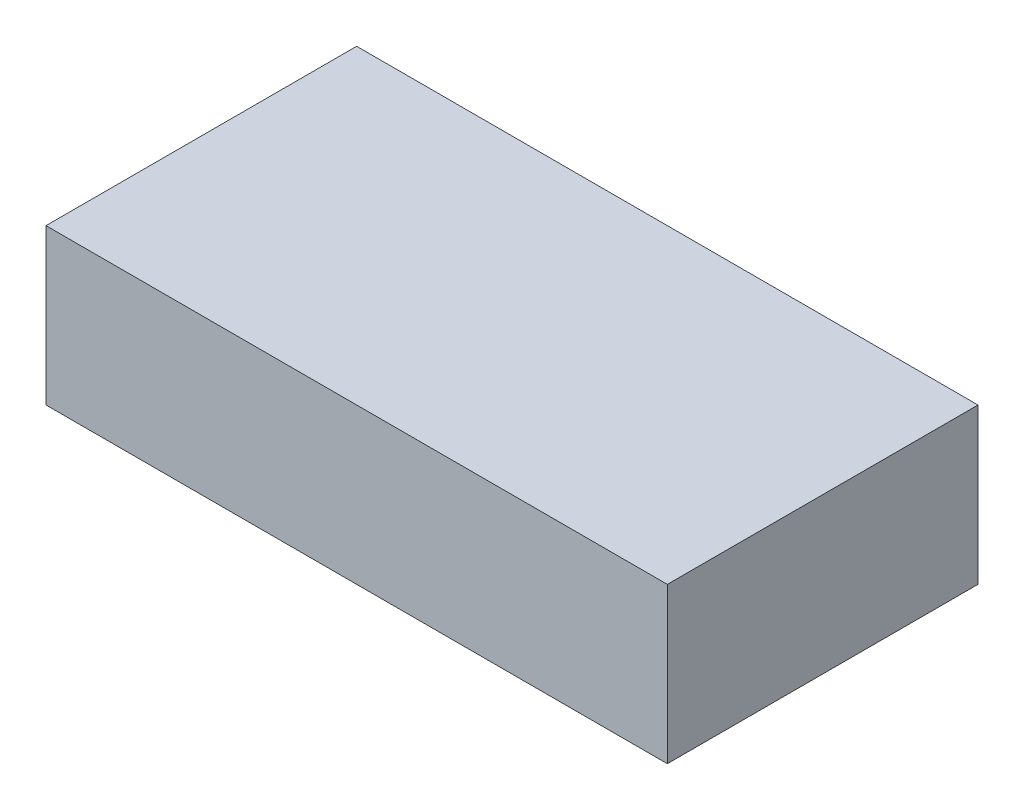
ISO-10303-21;
HEADER;
FILE_DESCRIPTION(('STEP AP214'),'2;1');
FILE_NAME('part.step','',(''),(''),'','','');
FILE_SCHEMA(('AUTOMOTIVE_DESIGN { 1 0 10303 214 1 1 1 1 }'));
ENDSEC;
DATA;
#1=APPLICATION_CONTEXT('core data for automotive mechanical design processes');
#2=APPLICATION_PROTOCOL_DEFINITION('international standard','automotive_design',2000,#1);
#3=PRODUCT_CONTEXT('',#1,'mechanical');
#4=PRODUCT('Part','Part','',(#3));
#5=PRODUCT_RELATED_PRODUCT_CATEGORY('part','',(#4));
#6=PRODUCT_DEFINITION_FORMATION('','',#4);
#7=PRODUCT_DEFINITION_CONTEXT('part definition',#1,'design');
#8=PRODUCT_DEFINITION('design','',#6,#7);
#9=PRODUCT_DEFINITION_SHAPE('','',#8);
#10=(LENGTH_UNIT() NAMED_UNIT(*) SI_UNIT(.MILLI.,.METRE.));
#11=(NAMED_UNIT(*) PLANE_ANGLE_UNIT() SI_UNIT($,.RADIAN.));
#12=(NAMED_UNIT(*) SI_UNIT($,.STERADIAN.) SOLID_ANGLE_UNIT());
#13=UNCERTAINTY_MEASURE_WITH_UNIT(LENGTH_MEASURE(1.E-05),#10,'distance_accuracy_value','');
#14=(GEOMETRIC_REPRESENTATION_CONTEXT(3) GLOBAL_UNCERTAINTY_ASSIGNED_CONTEXT((#13)) GLOBAL_UNIT_ASSIGNED_CONTEXT((#10,
#11,#12)) REPRESENTATION_CONTEXT('',''));
#15=CARTESIAN_POINT('',(0.,0.,0.));
#16=DIRECTION('',(0.,0.,1.));
#17=DIRECTION('',(1.,0.,0.));
#18=AXIS2_PLACEMENT_3D('',#15,#16,#17);
#19=CARTESIAN_POINT('',(0.,1.,-2.));
#20=DIRECTION('',(1.,0.,0.));
#21=DIRECTION('',(0.,0.,-1.));
#22=AXIS2_PLACEMENT_3D('',#19,#20,#21);
#23=PLANE('',#22);
#24=DIRECTION('',(0.,0.,1.));
#25=VECTOR('',#24,1.);
#26=CARTESIAN_POINT('',(0.,0.,-2.));
#27=LINE('',#26,#25);
#28=CARTESIAN_POINT('',(0.,0.,-2.));
#29=VERTEX_POINT('',#28);
#30=CARTESIAN_POINT('',(0.,0.,0.));
#31=VERTEX_POINT('',#30);
#32=EDGE_CURVE('E111',#29,#31,#27,.T.);
#33=ORIENTED_EDGE('',*,*,#32,.T.);
#34=DIRECTION('',(0.,-1.,0.));
#35=VECTOR('',#34,1.);
#36=CARTESIAN_POINT('',(0.,1.,0.));
#37=LINE('',#36,#35);
#38=CARTESIAN_POINT('',(0.,1.,0.));
#39=VERTEX_POINT('',#38);
#40=EDGE_CURVE('E11',#39,#31,#37,.T.);
#41=ORIENTED_EDGE('',*,*,#40,.F.);
#42=DIRECTION('',(0.,0.,1.));
#43=VECTOR('',#42,1.);
#44=CARTESIAN_POINT('',(0.,1.,-2.));
#45=LINE('',#44,#43);
#46=CARTESIAN_POINT('',(0.,1.,-2.));
#47=VERTEX_POINT('',#46);
#48=EDGE_CURVE('E95',#47,#39,#45,.T.);
#49=ORIENTED_EDGE('',*,*,#48,.F.);
#50=DIRECTION('',(0.,-1.,0.));
#51=VECTOR('',#50,1.);
#52=CARTESIAN_POINT('',(0.,1.,-2.));
#53=LINE('',#52,#51);
#54=EDGE_CURVE('E107',#47,#29,#53,.T.);
#55=ORIENTED_EDGE('',*,*,#54,.T.);
#56=EDGE_LOOP('',(#33,#41,#49,#55));
#57=FACE_BOUND('',#56,.T.);
#58=ADVANCED_FACE('F43',(#57),#23,.F.);
#59=CARTESIAN_POINT('',(0.,1.,0.));
#60=DIRECTION('',(0.,0.,-1.));
#61=DIRECTION('',(-1.,0.,0.));
#62=AXIS2_PLACEMENT_3D('',#59,#60,#61);
#63=PLANE('',#62);
#64=DIRECTION('',(1.,0.,0.));
#65=VECTOR('',#64,1.);
#66=CARTESIAN_POINT('',(0.,0.,0.));
#67=LINE('',#66,#65);
#68=CARTESIAN_POINT('',(4.,0.,0.));
#69=VERTEX_POINT('',#68);
#70=EDGE_CURVE('E100',#31,#69,#67,.T.);
#71=ORIENTED_EDGE('',*,*,#70,.T.);
#72=DIRECTION('',(0.,-1.,0.));
#73=VECTOR('',#72,1.);
#74=CARTESIAN_POINT('',(4.,1.,0.));
#75=LINE('',#74,#73);
#76=CARTESIAN_POINT('',(4.,1.,0.));
#77=VERTEX_POINT('',#76);
#78=EDGE_CURVE('E52',#77,#69,#75,.T.);
#79=ORIENTED_EDGE('',*,*,#78,.F.);
#80=DIRECTION('',(1.,0.,0.));
#81=VECTOR('',#80,1.);
#82=CARTESIAN_POINT('',(0.,1.,0.));
#83=LINE('',#82,#81);
#84=EDGE_CURVE('E90',#39,#77,#83,.T.);
#85=ORIENTED_EDGE('',*,*,#84,.F.);
#86=ORIENTED_EDGE('',*,*,#40,.T.);
#87=EDGE_LOOP('',(#71,#79,#85,#86));
#88=FACE_BOUND('',#87,.T.);
#89=ADVANCED_FACE('F99',(#88),#63,.F.);
#90=CARTESIAN_POINT('',(4.,1.,-2.));
#91=DIRECTION('',(-1.,0.,0.));
#92=DIRECTION('',(0.,0.,1.));
#93=AXIS2_PLACEMENT_3D('',#90,#91,#92);
#94=PLANE('',#93);
#95=DIRECTION('',(0.,0.,-1.));
#96=VECTOR('',#95,1.);
#97=CARTESIAN_POINT('',(4.,0.,-2.));
#98=LINE('',#97,#96);
#99=CARTESIAN_POINT('',(4.,0.,-2.));
#100=VERTEX_POINT('',#99);
#101=EDGE_CURVE('E77',#69,#100,#98,.T.);
#102=ORIENTED_EDGE('',*,*,#101,.T.);
#103=DIRECTION('',(0.,-1.,0.));
#104=VECTOR('',#103,1.);
#105=CARTESIAN_POINT('',(4.,1.,-2.));
#106=LINE('',#105,#104);
#107=CARTESIAN_POINT('',(4.,1.,-2.));
#108=VERTEX_POINT('',#107);
#109=EDGE_CURVE('E102',#108,#100,#106,.T.);
#110=ORIENTED_EDGE('',*,*,#109,.F.);
#111=DIRECTION('',(0.,0.,-1.));
#112=VECTOR('',#111,1.);
#113=CARTESIAN_POINT('',(4.,1.,-2.));
#114=LINE('',#113,#112);
#115=EDGE_CURVE('E93',#77,#108,#114,.T.);
#116=ORIENTED_EDGE('',*,*,#115,.F.);
#117=ORIENTED_EDGE('',*,*,#78,.T.);
#118=EDGE_LOOP('',(#102,#110,#116,#117));
#119=FACE_BOUND('',#118,.T.);
#120=ADVANCED_FACE('F103',(#119),#94,.F.);
#121=CARTESIAN_POINT('',(0.,1.,-2.));
#122=DIRECTION('',(0.,0.,1.));
#123=DIRECTION('',(1.,0.,0.));
#124=AXIS2_PLACEMENT_3D('',#121,#122,#123);
#125=PLANE('',#124);
#126=DIRECTION('',(-1.,0.,0.));
#127=VECTOR('',#126,1.);
#128=CARTESIAN_POINT('',(0.,0.,-2.));
#129=LINE('',#128,#127);
#130=EDGE_CURVE('E83',#100,#29,#129,.T.);
#131=ORIENTED_EDGE('',*,*,#130,.T.);
#132=ORIENTED_EDGE('',*,*,#54,.F.);
#133=DIRECTION('',(-1.,0.,0.));
#134=VECTOR('',#133,1.);
#135=CARTESIAN_POINT('',(0.,1.,-2.));
#136=LINE('',#135,#134);
#137=EDGE_CURVE('E60',#108,#47,#136,.T.);
#138=ORIENTED_EDGE('',*,*,#137,.F.);
#139=ORIENTED_EDGE('',*,*,#109,.T.);
#140=EDGE_LOOP('',(#131,#132,#138,#139));
#141=FACE_BOUND('',#140,.T.);
#142=ADVANCED_FACE('F124',(#141),#125,.F.);
#143=CARTESIAN_POINT('',(0.,1.,0.));
#144=DIRECTION('',(0.,1.,0.));
#145=DIRECTION('',(0.,0.,1.));
#146=AXIS2_PLACEMENT_3D('',#143,#144,#145);
#147=PLANE('',#146);
#148=ORIENTED_EDGE('',*,*,#48,.T.);
#149=ORIENTED_EDGE('',*,*,#84,.T.);
#150=ORIENTED_EDGE('',*,*,#115,.T.);
#151=ORIENTED_EDGE('',*,*,#137,.T.);
#152=EDGE_LOOP('',(#148,#149,#150,#151));
#153=FACE_BOUND('',#152,.T.);
#154=ADVANCED_FACE('F91',(#153),#147,.T.);
#155=CARTESIAN_POINT('',(0.,0.,0.));
#156=DIRECTION('',(0.,1.,0.));
#157=DIRECTION('',(0.,0.,1.));
#158=AXIS2_PLACEMENT_3D('',#155,#156,#157);
#159=PLANE('',#158);
#160=ORIENTED_EDGE('',*,*,#32,.F.);
#161=ORIENTED_EDGE('',*,*,#130,.F.);
#162=ORIENTED_EDGE('',*,*,#101,.F.);
#163=ORIENTED_EDGE('',*,*,#70,.F.);
#164=EDGE_LOOP('',(#160,#161,#162,#163));
#165=FACE_BOUND('',#164,.T.);
#166=ADVANCED_FACE('F127',(#165),#159,.F.);
#167=CLOSED_SHELL('',(#58,#89,#120,#142,#154,#166));
#168=MANIFOLD_SOLID_BREP('B2',#167);
#169=ADVANCED_BREP_SHAPE_REPRESENTATION('',(#18,#168),#14);
#170=SHAPE_DEFINITION_REPRESENTATION(#9,#169);
ENDSEC;
END-ISO-10303-21;
